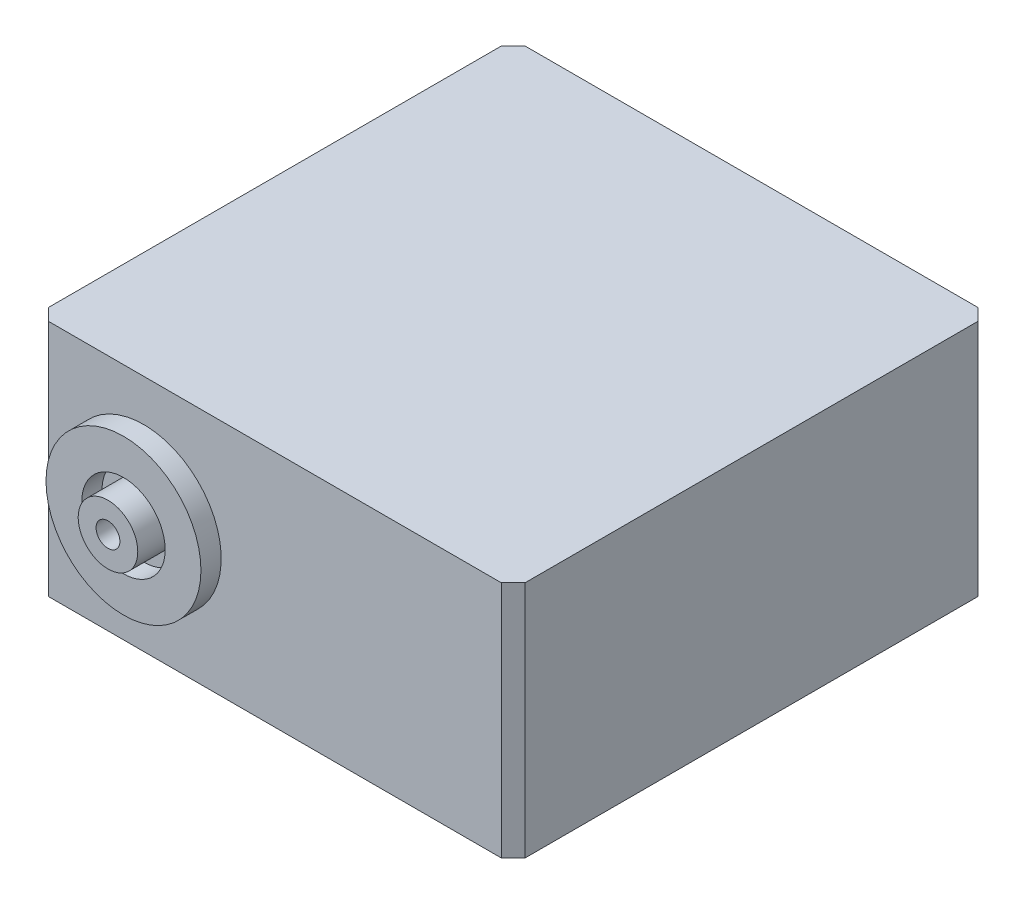
ISO-10303-21;
HEADER;
FILE_DESCRIPTION(('STEP AP214'),'2;1');
FILE_NAME('part.step','',(''),(''),'','','');
FILE_SCHEMA(('AUTOMOTIVE_DESIGN { 1 0 10303 214 1 1 1 1 }'));
ENDSEC;
DATA;
#1=APPLICATION_CONTEXT('core data for automotive mechanical design processes');
#2=APPLICATION_PROTOCOL_DEFINITION('international standard','automotive_design',2000,#1);
#3=PRODUCT_CONTEXT('',#1,'mechanical');
#4=PRODUCT('Part','Part','',(#3));
#5=PRODUCT_RELATED_PRODUCT_CATEGORY('part','',(#4));
#6=PRODUCT_DEFINITION_FORMATION('','',#4);
#7=PRODUCT_DEFINITION_CONTEXT('part definition',#1,'design');
#8=PRODUCT_DEFINITION('design','',#6,#7);
#9=PRODUCT_DEFINITION_SHAPE('','',#8);
#10=(LENGTH_UNIT() NAMED_UNIT(*) SI_UNIT(.MILLI.,.METRE.));
#11=(NAMED_UNIT(*) PLANE_ANGLE_UNIT() SI_UNIT($,.RADIAN.));
#12=(NAMED_UNIT(*) SI_UNIT($,.STERADIAN.) SOLID_ANGLE_UNIT());
#13=UNCERTAINTY_MEASURE_WITH_UNIT(LENGTH_MEASURE(1.E-05),#10,'distance_accuracy_value','');
#14=(GEOMETRIC_REPRESENTATION_CONTEXT(3) GLOBAL_UNCERTAINTY_ASSIGNED_CONTEXT((#13)) GLOBAL_UNIT_ASSIGNED_CONTEXT((#10,
#11,#12)) REPRESENTATION_CONTEXT('',''));
#15=CARTESIAN_POINT('',(0.,0.,0.));
#16=DIRECTION('',(0.,0.,1.));
#17=DIRECTION('',(1.,0.,0.));
#18=AXIS2_PLACEMENT_3D('',#15,#16,#17);
#19=CARTESIAN_POINT('',(-19.6433992561008,20.,13.8503048172004));
#20=DIRECTION('',(0.,0.,-1.));
#21=DIRECTION('',(-1.,0.,0.));
#22=AXIS2_PLACEMENT_3D('',#19,#20,#21);
#23=PLANE('',#22);
#24=CARTESIAN_POINT('',(-49.6433992561008,10.,13.8503048172004));
#25=DIRECTION('',(0.,0.,1.));
#26=DIRECTION('',(1.,0.,0.));
#27=AXIS2_PLACEMENT_3D('',#24,#25,#26);
#28=CIRCLE('',#27,3.5);
#29=CARTESIAN_POINT('',(-46.1433992561008,10.,13.8503048172004));
#30=VERTEX_POINT('',#29);
#31=EDGE_CURVE('E236',#30,#30,#28,.T.);
#32=ORIENTED_EDGE('',*,*,#31,.T.);
#33=EDGE_LOOP('',(#32));
#34=FACE_BOUND('',#33,.T.);
#35=CARTESIAN_POINT('',(-49.6433992561008,10.,13.8503048172004));
#36=DIRECTION('',(0.,0.,-1.));
#37=DIRECTION('',(-1.,0.,0.));
#38=AXIS2_PLACEMENT_3D('',#35,#36,#37);
#39=CIRCLE('',#38,2.5);
#40=CARTESIAN_POINT('',(-52.1433992561008,10.,13.8503048172004));
#41=VERTEX_POINT('',#40);
#42=EDGE_CURVE('E11',#41,#41,#39,.F.);
#43=ORIENTED_EDGE('',*,*,#42,.F.);
#44=EDGE_LOOP('',(#43));
#45=FACE_BOUND('',#44,.T.);
#46=ADVANCED_FACE('F34',(#34,#45),#23,.F.);
#47=DIRECTION('',(1.,0.,0.));
#48=VECTOR('',#47,1.);
#49=CARTESIAN_POINT('',(-19.6433992561008,0.,13.8503048172004));
#50=LINE('',#49,#48);
#51=CARTESIAN_POINT('',(-57.6433992561008,0.,13.8503048172004));
#52=VERTEX_POINT('',#51);
#53=CARTESIAN_POINT('',(-19.6433992561008,0.,13.8503048172004));
#54=VERTEX_POINT('',#53);
#55=EDGE_CURVE('E140',#52,#54,#50,.T.);
#56=ORIENTED_EDGE('',*,*,#55,.T.);
#57=DIRECTION('',(0.,-1.,0.));
#58=VECTOR('',#57,1.);
#59=CARTESIAN_POINT('',(-19.6433992561008,20.,13.8503048172004));
#60=LINE('',#59,#58);
#61=CARTESIAN_POINT('',(-19.6433992561008,20.,13.8503048172004));
#62=VERTEX_POINT('',#61);
#63=EDGE_CURVE('E151',#62,#54,#60,.T.);
#64=ORIENTED_EDGE('',*,*,#63,.F.);
#65=DIRECTION('',(1.,0.,0.));
#66=VECTOR('',#65,1.);
#67=CARTESIAN_POINT('',(-19.6433992561008,20.,13.8503048172004));
#68=LINE('',#67,#66);
#69=CARTESIAN_POINT('',(-57.6433992561008,20.,13.8503048172004));
#70=VERTEX_POINT('',#69);
#71=EDGE_CURVE('E206',#70,#62,#68,.T.);
#72=ORIENTED_EDGE('',*,*,#71,.F.);
#73=DIRECTION('',(0.,-1.,0.));
#74=VECTOR('',#73,1.);
#75=CARTESIAN_POINT('',(-57.6433992561008,20.,13.8503048172004));
#76=LINE('',#75,#74);
#77=EDGE_CURVE('E154',#70,#52,#76,.T.);
#78=ORIENTED_EDGE('',*,*,#77,.T.);
#79=EDGE_LOOP('',(#56,#64,#72,#78));
#80=FACE_BOUND('',#79,.T.);
#81=CARTESIAN_POINT('',(-49.6433992561008,10.,13.8503048172004));
#82=DIRECTION('',(0.,0.,-1.));
#83=DIRECTION('',(-1.,0.,0.));
#84=AXIS2_PLACEMENT_3D('',#81,#82,#83);
#85=CIRCLE('',#84,6.5);
#86=CARTESIAN_POINT('',(-56.1433992561008,10.,13.8503048172004));
#87=VERTEX_POINT('',#86);
#88=EDGE_CURVE('E43',#87,#87,#85,.F.);
#89=ORIENTED_EDGE('',*,*,#88,.F.);
#90=EDGE_LOOP('',(#89));
#91=FACE_BOUND('',#90,.T.);
#92=ADVANCED_FACE('F169',(#80,#91),#23,.F.);
#93=CARTESIAN_POINT('',(-57.6433992561008,20.,-26.1496951827996));
#94=DIRECTION('',(0.,0.,1.));
#95=DIRECTION('',(1.,0.,0.));
#96=AXIS2_PLACEMENT_3D('',#93,#94,#95);
#97=PLANE('',#96);
#98=DIRECTION('',(-1.,0.,0.));
#99=VECTOR('',#98,1.);
#100=CARTESIAN_POINT('',(-57.6433992561008,0.,-26.1496951827996));
#101=LINE('',#100,#99);
#102=CARTESIAN_POINT('',(-19.6433992561008,0.,-26.1496951827996));
#103=VERTEX_POINT('',#102);
#104=CARTESIAN_POINT('',(-57.6433992561008,0.,-26.1496951827996));
#105=VERTEX_POINT('',#104);
#106=EDGE_CURVE('E86',#103,#105,#101,.T.);
#107=ORIENTED_EDGE('',*,*,#106,.T.);
#108=DIRECTION('',(0.,-1.,0.));
#109=VECTOR('',#108,1.);
#110=CARTESIAN_POINT('',(-57.6433992561008,20.,-26.1496951827996));
#111=LINE('',#110,#109);
#112=CARTESIAN_POINT('',(-57.6433992561008,20.,-26.1496951827996));
#113=VERTEX_POINT('',#112);
#114=EDGE_CURVE('E128',#113,#105,#111,.T.);
#115=ORIENTED_EDGE('',*,*,#114,.F.);
#116=DIRECTION('',(-1.,0.,0.));
#117=VECTOR('',#116,1.);
#118=CARTESIAN_POINT('',(-57.6433992561008,20.,-26.1496951827996));
#119=LINE('',#118,#117);
#120=CARTESIAN_POINT('',(-19.6433992561008,20.,-26.1496951827996));
#121=VERTEX_POINT('',#120);
#122=EDGE_CURVE('E51',#121,#113,#119,.T.);
#123=ORIENTED_EDGE('',*,*,#122,.F.);
#124=DIRECTION('',(0.,-1.,0.));
#125=VECTOR('',#124,1.);
#126=CARTESIAN_POINT('',(-19.6433992561008,20.,-26.1496951827996));
#127=LINE('',#126,#125);
#128=EDGE_CURVE('E124',#121,#103,#127,.T.);
#129=ORIENTED_EDGE('',*,*,#128,.T.);
#130=EDGE_LOOP('',(#107,#115,#123,#129));
#131=FACE_BOUND('',#130,.T.);
#132=CARTESIAN_POINT('',(-49.6433992561008,10.,-26.1496951827996));
#133=DIRECTION('',(0.,0.,1.));
#134=DIRECTION('',(1.,0.,0.));
#135=AXIS2_PLACEMENT_3D('',#132,#133,#134);
#136=CIRCLE('',#135,6.5);
#137=CARTESIAN_POINT('',(-43.1433992561008,10.,-26.1496951827996));
#138=VERTEX_POINT('',#137);
#139=EDGE_CURVE('E162',#138,#138,#136,.F.);
#140=ORIENTED_EDGE('',*,*,#139,.F.);
#141=EDGE_LOOP('',(#140));
#142=FACE_BOUND('',#141,.T.);
#143=ADVANCED_FACE('F171',(#131,#142),#97,.F.);
#144=CARTESIAN_POINT('',(-58.6433992561008,20.,-25.1496951827996));
#145=DIRECTION('',(0.707106781186548,0.,0.707106781186548));
#146=DIRECTION('',(0.707106781186548,0.,-0.707106781186548));
#147=AXIS2_PLACEMENT_3D('',#144,#145,#146);
#148=PLANE('',#147);
#149=DIRECTION('',(-0.707106781186547,0.,0.707106781186547));
#150=VECTOR('',#149,1.);
#151=CARTESIAN_POINT('',(-58.6433992561008,0.,-25.1496951827996));
#152=LINE('',#151,#150);
#153=CARTESIAN_POINT('',(-58.6433992561008,0.,-25.1496951827996));
#154=VERTEX_POINT('',#153);
#155=EDGE_CURVE('E132',#105,#154,#152,.T.);
#156=ORIENTED_EDGE('',*,*,#155,.T.);
#157=DIRECTION('',(0.,-1.,0.));
#158=VECTOR('',#157,1.);
#159=CARTESIAN_POINT('',(-58.6433992561008,20.,-25.1496951827996));
#160=LINE('',#159,#158);
#161=CARTESIAN_POINT('',(-58.6433992561008,20.,-25.1496951827996));
#162=VERTEX_POINT('',#161);
#163=EDGE_CURVE('E160',#162,#154,#160,.T.);
#164=ORIENTED_EDGE('',*,*,#163,.F.);
#165=DIRECTION('',(-0.707106781186547,0.,0.707106781186547));
#166=VECTOR('',#165,1.);
#167=CARTESIAN_POINT('',(-58.6433992561008,20.,-25.1496951827996));
#168=LINE('',#167,#166);
#169=EDGE_CURVE('E147',#113,#162,#168,.T.);
#170=ORIENTED_EDGE('',*,*,#169,.F.);
#171=ORIENTED_EDGE('',*,*,#114,.T.);
#172=EDGE_LOOP('',(#156,#164,#170,#171));
#173=FACE_BOUND('',#172,.T.);
#174=ADVANCED_FACE('F36',(#173),#148,.F.);
#175=CARTESIAN_POINT('',(-58.6433992561008,20.,12.8503048172004));
#176=DIRECTION('',(1.,0.,0.));
#177=DIRECTION('',(0.,0.,-1.));
#178=AXIS2_PLACEMENT_3D('',#175,#176,#177);
#179=PLANE('',#178);
#180=DIRECTION('',(0.,0.,1.));
#181=VECTOR('',#180,1.);
#182=CARTESIAN_POINT('',(-58.6433992561008,0.,12.8503048172004));
#183=LINE('',#182,#181);
#184=CARTESIAN_POINT('',(-58.6433992561008,0.,12.8503048172004));
#185=VERTEX_POINT('',#184);
#186=EDGE_CURVE('E135',#154,#185,#183,.T.);
#187=ORIENTED_EDGE('',*,*,#186,.T.);
#188=DIRECTION('',(0.,-1.,0.));
#189=VECTOR('',#188,1.);
#190=CARTESIAN_POINT('',(-58.6433992561008,20.,12.8503048172004));
#191=LINE('',#190,#189);
#192=CARTESIAN_POINT('',(-58.6433992561008,20.,12.8503048172004));
#193=VERTEX_POINT('',#192);
#194=EDGE_CURVE('E157',#193,#185,#191,.T.);
#195=ORIENTED_EDGE('',*,*,#194,.F.);
#196=DIRECTION('',(0.,0.,1.));
#197=VECTOR('',#196,1.);
#198=CARTESIAN_POINT('',(-58.6433992561008,20.,12.8503048172004));
#199=LINE('',#198,#197);
#200=EDGE_CURVE('E95',#162,#193,#199,.T.);
#201=ORIENTED_EDGE('',*,*,#200,.F.);
#202=ORIENTED_EDGE('',*,*,#163,.T.);
#203=EDGE_LOOP('',(#187,#195,#201,#202));
#204=FACE_BOUND('',#203,.T.);
#205=ADVANCED_FACE('F186',(#204),#179,.F.);
#206=CARTESIAN_POINT('',(-57.6433992561008,20.,13.8503048172004));
#207=DIRECTION('',(0.707106781186548,0.,-0.707106781186548));
#208=DIRECTION('',(-0.707106781186548,0.,-0.707106781186548));
#209=AXIS2_PLACEMENT_3D('',#206,#207,#208);
#210=PLANE('',#209);
#211=DIRECTION('',(0.707106781186547,0.,0.707106781186547));
#212=VECTOR('',#211,1.);
#213=CARTESIAN_POINT('',(-57.6433992561008,0.,13.8503048172004));
#214=LINE('',#213,#212);
#215=EDGE_CURVE('E138',#185,#52,#214,.T.);
#216=ORIENTED_EDGE('',*,*,#215,.T.);
#217=ORIENTED_EDGE('',*,*,#77,.F.);
#218=DIRECTION('',(0.707106781186547,0.,0.707106781186547));
#219=VECTOR('',#218,1.);
#220=CARTESIAN_POINT('',(-57.6433992561008,20.,13.8503048172004));
#221=LINE('',#220,#219);
#222=EDGE_CURVE('E199',#193,#70,#221,.T.);
#223=ORIENTED_EDGE('',*,*,#222,.F.);
#224=ORIENTED_EDGE('',*,*,#194,.T.);
#225=EDGE_LOOP('',(#216,#217,#223,#224));
#226=FACE_BOUND('',#225,.T.);
#227=ADVANCED_FACE('F184',(#226),#210,.F.);
#228=CARTESIAN_POINT('',(-18.6433992561008,20.,12.8503048172004));
#229=DIRECTION('',(-0.707106781186548,0.,-0.707106781186548));
#230=DIRECTION('',(-0.707106781186548,0.,0.707106781186548));
#231=AXIS2_PLACEMENT_3D('',#228,#229,#230);
#232=PLANE('',#231);
#233=DIRECTION('',(0.707106781186547,0.,-0.707106781186547));
#234=VECTOR('',#233,1.);
#235=CARTESIAN_POINT('',(-18.6433992561008,0.,12.8503048172004));
#236=LINE('',#235,#234);
#237=CARTESIAN_POINT('',(-18.6433992561008,0.,12.8503048172004));
#238=VERTEX_POINT('',#237);
#239=EDGE_CURVE('E142',#54,#238,#236,.T.);
#240=ORIENTED_EDGE('',*,*,#239,.T.);
#241=DIRECTION('',(0.,-1.,0.));
#242=VECTOR('',#241,1.);
#243=CARTESIAN_POINT('',(-18.6433992561008,20.,12.8503048172004));
#244=LINE('',#243,#242);
#245=CARTESIAN_POINT('',(-18.6433992561008,20.,12.8503048172004));
#246=VERTEX_POINT('',#245);
#247=EDGE_CURVE('E123',#246,#238,#244,.T.);
#248=ORIENTED_EDGE('',*,*,#247,.F.);
#249=DIRECTION('',(0.707106781186547,0.,-0.707106781186547));
#250=VECTOR('',#249,1.);
#251=CARTESIAN_POINT('',(-18.6433992561008,20.,12.8503048172004));
#252=LINE('',#251,#250);
#253=EDGE_CURVE('E114',#62,#246,#252,.T.);
#254=ORIENTED_EDGE('',*,*,#253,.F.);
#255=ORIENTED_EDGE('',*,*,#63,.T.);
#256=EDGE_LOOP('',(#240,#248,#254,#255));
#257=FACE_BOUND('',#256,.T.);
#258=ADVANCED_FACE('F182',(#257),#232,.F.);
#259=CARTESIAN_POINT('',(-18.6433992561008,20.,-25.1496951827996));
#260=DIRECTION('',(-1.,0.,0.));
#261=DIRECTION('',(0.,0.,1.));
#262=AXIS2_PLACEMENT_3D('',#259,#260,#261);
#263=PLANE('',#262);
#264=DIRECTION('',(0.,0.,-1.));
#265=VECTOR('',#264,1.);
#266=CARTESIAN_POINT('',(-18.6433992561008,0.,-25.1496951827996));
#267=LINE('',#266,#265);
#268=CARTESIAN_POINT('',(-18.6433992561008,0.,-25.1496951827996));
#269=VERTEX_POINT('',#268);
#270=EDGE_CURVE('E122',#238,#269,#267,.T.);
#271=ORIENTED_EDGE('',*,*,#270,.T.);
#272=DIRECTION('',(0.,-1.,0.));
#273=VECTOR('',#272,1.);
#274=CARTESIAN_POINT('',(-18.6433992561008,20.,-25.1496951827996));
#275=LINE('',#274,#273);
#276=CARTESIAN_POINT('',(-18.6433992561008,20.,-25.1496951827996));
#277=VERTEX_POINT('',#276);
#278=EDGE_CURVE('E119',#277,#269,#275,.T.);
#279=ORIENTED_EDGE('',*,*,#278,.F.);
#280=DIRECTION('',(0.,0.,-1.));
#281=VECTOR('',#280,1.);
#282=CARTESIAN_POINT('',(-18.6433992561008,20.,-25.1496951827996));
#283=LINE('',#282,#281);
#284=EDGE_CURVE('E108',#246,#277,#283,.T.);
#285=ORIENTED_EDGE('',*,*,#284,.F.);
#286=ORIENTED_EDGE('',*,*,#247,.T.);
#287=EDGE_LOOP('',(#271,#279,#285,#286));
#288=FACE_BOUND('',#287,.T.);
#289=ADVANCED_FACE('F120',(#288),#263,.F.);
#290=CARTESIAN_POINT('',(-19.6433992561008,20.,-26.1496951827996));
#291=DIRECTION('',(-0.707106781186548,0.,0.707106781186548));
#292=DIRECTION('',(0.707106781186548,0.,0.707106781186548));
#293=AXIS2_PLACEMENT_3D('',#290,#291,#292);
#294=PLANE('',#293);
#295=DIRECTION('',(-0.707106781186547,0.,-0.707106781186547));
#296=VECTOR('',#295,1.);
#297=CARTESIAN_POINT('',(-19.6433992561008,0.,-26.1496951827996));
#298=LINE('',#297,#296);
#299=EDGE_CURVE('E80',#269,#103,#298,.T.);
#300=ORIENTED_EDGE('',*,*,#299,.T.);
#301=ORIENTED_EDGE('',*,*,#128,.F.);
#302=DIRECTION('',(-0.707106781186547,0.,-0.707106781186547));
#303=VECTOR('',#302,1.);
#304=CARTESIAN_POINT('',(-19.6433992561008,20.,-26.1496951827996));
#305=LINE('',#304,#303);
#306=EDGE_CURVE('E112',#277,#121,#305,.T.);
#307=ORIENTED_EDGE('',*,*,#306,.F.);
#308=ORIENTED_EDGE('',*,*,#278,.T.);
#309=EDGE_LOOP('',(#300,#301,#307,#308));
#310=FACE_BOUND('',#309,.T.);
#311=ADVANCED_FACE('F126',(#310),#294,.F.);
#312=CARTESIAN_POINT('',(0.,20.,0.));
#313=DIRECTION('',(0.,-1.,0.));
#314=DIRECTION('',(0.,0.,-1.));
#315=AXIS2_PLACEMENT_3D('',#312,#313,#314);
#316=PLANE('',#315);
#317=ORIENTED_EDGE('',*,*,#169,.T.);
#318=ORIENTED_EDGE('',*,*,#200,.T.);
#319=ORIENTED_EDGE('',*,*,#222,.T.);
#320=ORIENTED_EDGE('',*,*,#71,.T.);
#321=ORIENTED_EDGE('',*,*,#253,.T.);
#322=ORIENTED_EDGE('',*,*,#284,.T.);
#323=ORIENTED_EDGE('',*,*,#306,.T.);
#324=ORIENTED_EDGE('',*,*,#122,.T.);
#325=EDGE_LOOP('',(#317,#318,#319,#320,#321,#322,#323,#324));
#326=FACE_BOUND('',#325,.T.);
#327=ADVANCED_FACE('F110',(#326),#316,.F.);
#328=CARTESIAN_POINT('',(0.,0.,0.));
#329=DIRECTION('',(0.,-1.,0.));
#330=DIRECTION('',(0.,0.,-1.));
#331=AXIS2_PLACEMENT_3D('',#328,#329,#330);
#332=PLANE('',#331);
#333=ORIENTED_EDGE('',*,*,#155,.F.);
#334=ORIENTED_EDGE('',*,*,#106,.F.);
#335=ORIENTED_EDGE('',*,*,#299,.F.);
#336=ORIENTED_EDGE('',*,*,#270,.F.);
#337=ORIENTED_EDGE('',*,*,#239,.F.);
#338=ORIENTED_EDGE('',*,*,#55,.F.);
#339=ORIENTED_EDGE('',*,*,#215,.F.);
#340=ORIENTED_EDGE('',*,*,#186,.F.);
#341=EDGE_LOOP('',(#333,#334,#335,#336,#337,#338,#339,#340));
#342=FACE_BOUND('',#341,.T.);
#343=ADVANCED_FACE('F201',(#342),#332,.T.);
#344=CARTESIAN_POINT('',(-49.6433992561008,10.,-27.8496951827996));
#345=DIRECTION('',(0.,0.,-1.));
#346=DIRECTION('',(-1.,0.,0.));
#347=AXIS2_PLACEMENT_3D('',#344,#345,#346);
#348=PLANE('',#347);
#349=CARTESIAN_POINT('',(-49.6433992561008,10.,-27.8496951827996));
#350=DIRECTION('',(0.,0.,-1.));
#351=DIRECTION('',(-1.,0.,0.));
#352=AXIS2_PLACEMENT_3D('',#349,#350,#351);
#353=CIRCLE('',#352,6.5);
#354=CARTESIAN_POINT('',(-56.1433992561008,10.,-27.8496951827996));
#355=VERTEX_POINT('',#354);
#356=EDGE_CURVE('E136',#355,#355,#353,.T.);
#357=ORIENTED_EDGE('',*,*,#356,.T.);
#358=EDGE_LOOP('',(#357));
#359=FACE_BOUND('',#358,.T.);
#360=CARTESIAN_POINT('',(-49.6433992561008,10.,-27.8496951827996));
#361=DIRECTION('',(0.,0.,-1.));
#362=DIRECTION('',(-1.,0.,0.));
#363=AXIS2_PLACEMENT_3D('',#360,#361,#362);
#364=CIRCLE('',#363,3.);
#365=CARTESIAN_POINT('',(-52.6433992561008,10.,-27.8496951827996));
#366=VERTEX_POINT('',#365);
#367=EDGE_CURVE('E214',#366,#366,#364,.T.);
#368=ORIENTED_EDGE('',*,*,#367,.F.);
#369=EDGE_LOOP('',(#368));
#370=FACE_BOUND('',#369,.T.);
#371=ADVANCED_FACE('F310',(#359,#370),#348,.T.);
#372=CARTESIAN_POINT('',(-49.6433992561008,10.,-27.8496951827996));
#373=DIRECTION('',(0.,0.,1.));
#374=DIRECTION('',(1.,0.,0.));
#375=AXIS2_PLACEMENT_3D('',#372,#373,#374);
#376=CYLINDRICAL_SURFACE('',#375,6.5);
#377=ORIENTED_EDGE('',*,*,#356,.F.);
#378=EDGE_LOOP('',(#377));
#379=FACE_BOUND('',#378,.T.);
#380=ORIENTED_EDGE('',*,*,#139,.T.);
#381=EDGE_LOOP('',(#380));
#382=FACE_BOUND('',#381,.T.);
#383=ADVANCED_FACE('F308',(#379,#382),#376,.T.);
#384=CARTESIAN_POINT('',(-49.6433992561008,10.,-28.8496951827996));
#385=DIRECTION('',(0.,0.,1.));
#386=DIRECTION('',(1.,0.,0.));
#387=AXIS2_PLACEMENT_3D('',#384,#385,#386);
#388=CYLINDRICAL_SURFACE('',#387,3.);
#389=ORIENTED_EDGE('',*,*,#367,.T.);
#390=EDGE_LOOP('',(#389));
#391=FACE_BOUND('',#390,.T.);
#392=CARTESIAN_POINT('',(-49.6433992561008,10.,-28.8496951827996));
#393=DIRECTION('',(0.,0.,-1.));
#394=DIRECTION('',(-1.,0.,0.));
#395=AXIS2_PLACEMENT_3D('',#392,#393,#394);
#396=CIRCLE('',#395,3.);
#397=CARTESIAN_POINT('',(-52.6433992561008,10.,-28.8496951827996));
#398=VERTEX_POINT('',#397);
#399=EDGE_CURVE('E217',#398,#398,#396,.T.);
#400=ORIENTED_EDGE('',*,*,#399,.F.);
#401=EDGE_LOOP('',(#400));
#402=FACE_BOUND('',#401,.T.);
#403=ADVANCED_FACE('F301',(#391,#402),#388,.T.);
#404=CARTESIAN_POINT('',(-49.6433992561008,10.,-28.8496951827996));
#405=DIRECTION('',(0.,0.,-1.));
#406=DIRECTION('',(-1.,0.,0.));
#407=AXIS2_PLACEMENT_3D('',#404,#405,#406);
#408=PLANE('',#407);
#409=CARTESIAN_POINT('',(-49.6433992561008,10.,-28.8496951827996));
#410=DIRECTION('',(0.,0.,-1.));
#411=DIRECTION('',(-1.,0.,0.));
#412=AXIS2_PLACEMENT_3D('',#409,#410,#411);
#413=CIRCLE('',#412,3.2);
#414=CARTESIAN_POINT('',(-52.8433992561008,10.,-28.8496951827996));
#415=VERTEX_POINT('',#414);
#416=EDGE_CURVE('E221',#415,#415,#413,.T.);
#417=ORIENTED_EDGE('',*,*,#416,.F.);
#418=EDGE_LOOP('',(#417));
#419=FACE_BOUND('',#418,.T.);
#420=ORIENTED_EDGE('',*,*,#399,.T.);
#421=EDGE_LOOP('',(#420));
#422=FACE_BOUND('',#421,.T.);
#423=ADVANCED_FACE('F298',(#419,#422),#408,.F.);
#424=CARTESIAN_POINT('',(-49.6433992561008,10.,-31.8496951827996));
#425=DIRECTION('',(0.,0.,1.));
#426=DIRECTION('',(1.,0.,0.));
#427=AXIS2_PLACEMENT_3D('',#424,#425,#426);
#428=CYLINDRICAL_SURFACE('',#427,3.2);
#429=CARTESIAN_POINT('',(-49.6433992561008,10.,-31.8496951827996));
#430=DIRECTION('',(0.,0.,-1.));
#431=DIRECTION('',(-1.,0.,0.));
#432=AXIS2_PLACEMENT_3D('',#429,#430,#431);
#433=CIRCLE('',#432,3.2);
#434=CARTESIAN_POINT('',(-52.8433992561008,10.,-31.8496951827996));
#435=VERTEX_POINT('',#434);
#436=EDGE_CURVE('E220',#435,#435,#433,.T.);
#437=ORIENTED_EDGE('',*,*,#436,.F.);
#438=EDGE_LOOP('',(#437));
#439=FACE_BOUND('',#438,.T.);
#440=ORIENTED_EDGE('',*,*,#416,.T.);
#441=EDGE_LOOP('',(#440));
#442=FACE_BOUND('',#441,.T.);
#443=ADVANCED_FACE('F296',(#439,#442),#428,.T.);
#444=CARTESIAN_POINT('',(-49.6433992561008,10.,-31.8496951827996));
#445=DIRECTION('',(0.,0.,-1.));
#446=DIRECTION('',(-1.,0.,0.));
#447=AXIS2_PLACEMENT_3D('',#444,#445,#446);
#448=PLANE('',#447);
#449=CARTESIAN_POINT('',(-49.6433992561008,10.,-31.8496951827996));
#450=DIRECTION('',(0.,0.,-1.));
#451=DIRECTION('',(-1.,0.,0.));
#452=AXIS2_PLACEMENT_3D('',#449,#450,#451);
#453=CIRCLE('',#452,0.999999999999998);
#454=CARTESIAN_POINT('',(-50.6433992561008,10.,-31.8496951827996));
#455=VERTEX_POINT('',#454);
#456=EDGE_CURVE('E227',#455,#455,#453,.T.);
#457=ORIENTED_EDGE('',*,*,#456,.F.);
#458=EDGE_LOOP('',(#457));
#459=FACE_BOUND('',#458,.T.);
#460=ORIENTED_EDGE('',*,*,#436,.T.);
#461=EDGE_LOOP('',(#460));
#462=FACE_BOUND('',#461,.T.);
#463=ADVANCED_FACE('F292',(#459,#462),#448,.T.);
#464=CARTESIAN_POINT('',(-49.6433992561008,10.,-26.1496951827996));
#465=DIRECTION('',(0.,0.,-1.));
#466=DIRECTION('',(-1.,0.,0.));
#467=AXIS2_PLACEMENT_3D('',#464,#465,#466);
#468=CYLINDRICAL_SURFACE('',#467,0.999999999999998);
#469=CARTESIAN_POINT('',(-49.6433992561008,10.,-26.1496951827996));
#470=DIRECTION('',(0.,0.,-1.));
#471=DIRECTION('',(-1.,0.,0.));
#472=AXIS2_PLACEMENT_3D('',#469,#470,#471);
#473=CIRCLE('',#472,0.999999999999998);
#474=CARTESIAN_POINT('',(-50.6433992561008,10.,-26.1496951827996));
#475=VERTEX_POINT('',#474);
#476=EDGE_CURVE('E224',#475,#475,#473,.T.);
#477=ORIENTED_EDGE('',*,*,#476,.F.);
#478=EDGE_LOOP('',(#477));
#479=FACE_BOUND('',#478,.T.);
#480=ORIENTED_EDGE('',*,*,#456,.T.);
#481=EDGE_LOOP('',(#480));
#482=FACE_BOUND('',#481,.T.);
#483=ADVANCED_FACE('F288',(#479,#482),#468,.F.);
#484=CARTESIAN_POINT('',(-49.6433992561008,10.,-26.1496951827996));
#485=DIRECTION('',(0.,0.,-1.));
#486=DIRECTION('',(-1.,0.,0.));
#487=AXIS2_PLACEMENT_3D('',#484,#485,#486);
#488=PLANE('',#487);
#489=ORIENTED_EDGE('',*,*,#476,.T.);
#490=EDGE_LOOP('',(#489));
#491=FACE_BOUND('',#490,.T.);
#492=ADVANCED_FACE('F281',(#491),#488,.T.);
#493=CARTESIAN_POINT('',(-49.6433992561008,10.,15.5503048172004));
#494=DIRECTION('',(0.,0.,1.));
#495=DIRECTION('',(1.,0.,0.));
#496=AXIS2_PLACEMENT_3D('',#493,#494,#495);
#497=PLANE('',#496);
#498=CARTESIAN_POINT('',(-49.6433992561008,10.,15.5503048172004));
#499=DIRECTION('',(0.,0.,1.));
#500=DIRECTION('',(1.,0.,0.));
#501=AXIS2_PLACEMENT_3D('',#498,#499,#500);
#502=CIRCLE('',#501,6.5);
#503=CARTESIAN_POINT('',(-43.1433992561008,10.,15.5503048172004));
#504=VERTEX_POINT('',#503);
#505=EDGE_CURVE('E230',#504,#504,#502,.T.);
#506=ORIENTED_EDGE('',*,*,#505,.T.);
#507=EDGE_LOOP('',(#506));
#508=FACE_BOUND('',#507,.T.);
#509=CARTESIAN_POINT('',(-49.6433992561008,10.,15.5503048172004));
#510=DIRECTION('',(0.,0.,1.));
#511=DIRECTION('',(1.,0.,0.));
#512=AXIS2_PLACEMENT_3D('',#509,#510,#511);
#513=CIRCLE('',#512,3.5);
#514=CARTESIAN_POINT('',(-46.1433992561008,10.,15.5503048172004));
#515=VERTEX_POINT('',#514);
#516=EDGE_CURVE('E235',#515,#515,#513,.T.);
#517=ORIENTED_EDGE('',*,*,#516,.F.);
#518=EDGE_LOOP('',(#517));
#519=FACE_BOUND('',#518,.T.);
#520=ADVANCED_FACE('F278',(#508,#519),#497,.T.);
#521=CARTESIAN_POINT('',(-49.6433992561008,10.,15.5503048172004));
#522=DIRECTION('',(0.,0.,-1.));
#523=DIRECTION('',(-1.,0.,0.));
#524=AXIS2_PLACEMENT_3D('',#521,#522,#523);
#525=CYLINDRICAL_SURFACE('',#524,6.5);
#526=ORIENTED_EDGE('',*,*,#505,.F.);
#527=EDGE_LOOP('',(#526));
#528=FACE_BOUND('',#527,.T.);
#529=ORIENTED_EDGE('',*,*,#88,.T.);
#530=EDGE_LOOP('',(#529));
#531=FACE_BOUND('',#530,.T.);
#532=ADVANCED_FACE('F167',(#528,#531),#525,.T.);
#533=CARTESIAN_POINT('',(-49.6433992561008,10.,15.5503048172004));
#534=DIRECTION('',(0.,0.,-1.));
#535=DIRECTION('',(-1.,0.,0.));
#536=AXIS2_PLACEMENT_3D('',#533,#534,#535);
#537=CYLINDRICAL_SURFACE('',#536,3.5);
#538=ORIENTED_EDGE('',*,*,#516,.T.);
#539=EDGE_LOOP('',(#538));
#540=FACE_BOUND('',#539,.T.);
#541=ORIENTED_EDGE('',*,*,#31,.F.);
#542=EDGE_LOOP('',(#541));
#543=FACE_BOUND('',#542,.T.);
#544=ADVANCED_FACE('F268',(#540,#543),#537,.F.);
#545=CARTESIAN_POINT('',(-49.6433992561008,10.,16.8503048172004));
#546=DIRECTION('',(0.,0.,-1.));
#547=DIRECTION('',(-1.,0.,0.));
#548=AXIS2_PLACEMENT_3D('',#545,#546,#547);
#549=CYLINDRICAL_SURFACE('',#548,2.5);
#550=CARTESIAN_POINT('',(-49.6433992561008,10.,16.8503048172004));
#551=DIRECTION('',(0.,0.,1.));
#552=DIRECTION('',(1.,0.,0.));
#553=AXIS2_PLACEMENT_3D('',#550,#551,#552);
#554=CIRCLE('',#553,2.5);
#555=CARTESIAN_POINT('',(-47.1433992561008,10.,16.8503048172004));
#556=VERTEX_POINT('',#555);
#557=EDGE_CURVE('E239',#556,#556,#554,.T.);
#558=ORIENTED_EDGE('',*,*,#557,.F.);
#559=EDGE_LOOP('',(#558));
#560=FACE_BOUND('',#559,.T.);
#561=ORIENTED_EDGE('',*,*,#42,.T.);
#562=EDGE_LOOP('',(#561));
#563=FACE_BOUND('',#562,.T.);
#564=ADVANCED_FACE('F262',(#560,#563),#549,.T.);
#565=CARTESIAN_POINT('',(-49.6433992561008,10.,16.8503048172004));
#566=DIRECTION('',(0.,0.,1.));
#567=DIRECTION('',(1.,0.,0.));
#568=AXIS2_PLACEMENT_3D('',#565,#566,#567);
#569=PLANE('',#568);
#570=CARTESIAN_POINT('',(-49.6433992561008,10.,16.8503048172004));
#571=DIRECTION('',(0.,0.,1.));
#572=DIRECTION('',(1.,0.,0.));
#573=AXIS2_PLACEMENT_3D('',#570,#571,#572);
#574=CIRCLE('',#573,0.999999999999998);
#575=CARTESIAN_POINT('',(-48.6433992561008,10.,16.8503048172004));
#576=VERTEX_POINT('',#575);
#577=EDGE_CURVE('E245',#576,#576,#574,.T.);
#578=ORIENTED_EDGE('',*,*,#577,.F.);
#579=EDGE_LOOP('',(#578));
#580=FACE_BOUND('',#579,.T.);
#581=ORIENTED_EDGE('',*,*,#557,.T.);
#582=EDGE_LOOP('',(#581));
#583=FACE_BOUND('',#582,.T.);
#584=ADVANCED_FACE('F256',(#580,#583),#569,.T.);
#585=CARTESIAN_POINT('',(-49.6433992561008,10.,11.8503048172004));
#586=DIRECTION('',(0.,0.,1.));
#587=DIRECTION('',(1.,0.,0.));
#588=AXIS2_PLACEMENT_3D('',#585,#586,#587);
#589=CYLINDRICAL_SURFACE('',#588,0.999999999999998);
#590=CARTESIAN_POINT('',(-49.6433992561008,10.,11.8503048172004));
#591=DIRECTION('',(0.,0.,1.));
#592=DIRECTION('',(1.,0.,0.));
#593=AXIS2_PLACEMENT_3D('',#590,#591,#592);
#594=CIRCLE('',#593,0.999999999999998);
#595=CARTESIAN_POINT('',(-48.6433992561008,10.,11.8503048172004));
#596=VERTEX_POINT('',#595);
#597=EDGE_CURVE('E244',#596,#596,#594,.T.);
#598=ORIENTED_EDGE('',*,*,#597,.F.);
#599=EDGE_LOOP('',(#598));
#600=FACE_BOUND('',#599,.T.);
#601=ORIENTED_EDGE('',*,*,#577,.T.);
#602=EDGE_LOOP('',(#601));
#603=FACE_BOUND('',#602,.T.);
#604=ADVANCED_FACE('F253',(#600,#603),#589,.F.);
#605=CARTESIAN_POINT('',(-49.6433992561008,10.,11.8503048172004));
#606=DIRECTION('',(0.,0.,1.));
#607=DIRECTION('',(1.,0.,0.));
#608=AXIS2_PLACEMENT_3D('',#605,#606,#607);
#609=PLANE('',#608);
#610=ORIENTED_EDGE('',*,*,#597,.T.);
#611=EDGE_LOOP('',(#610));
#612=FACE_BOUND('',#611,.T.);
#613=ADVANCED_FACE('F251',(#612),#609,.T.);
#614=CLOSED_SHELL('',(#46,#92,#143,#174,#205,#227,#258,#289,#311,#327,#343,#371,#383,#403,#423,
#443,#463,#483,#492,#520,#532,#544,#564,#584,#604,#613));
#615=MANIFOLD_SOLID_BREP('B2',#614);
#616=ADVANCED_BREP_SHAPE_REPRESENTATION('',(#18,#615),#14);
#617=SHAPE_DEFINITION_REPRESENTATION(#9,#616);
ENDSEC;
END-ISO-10303-21;
